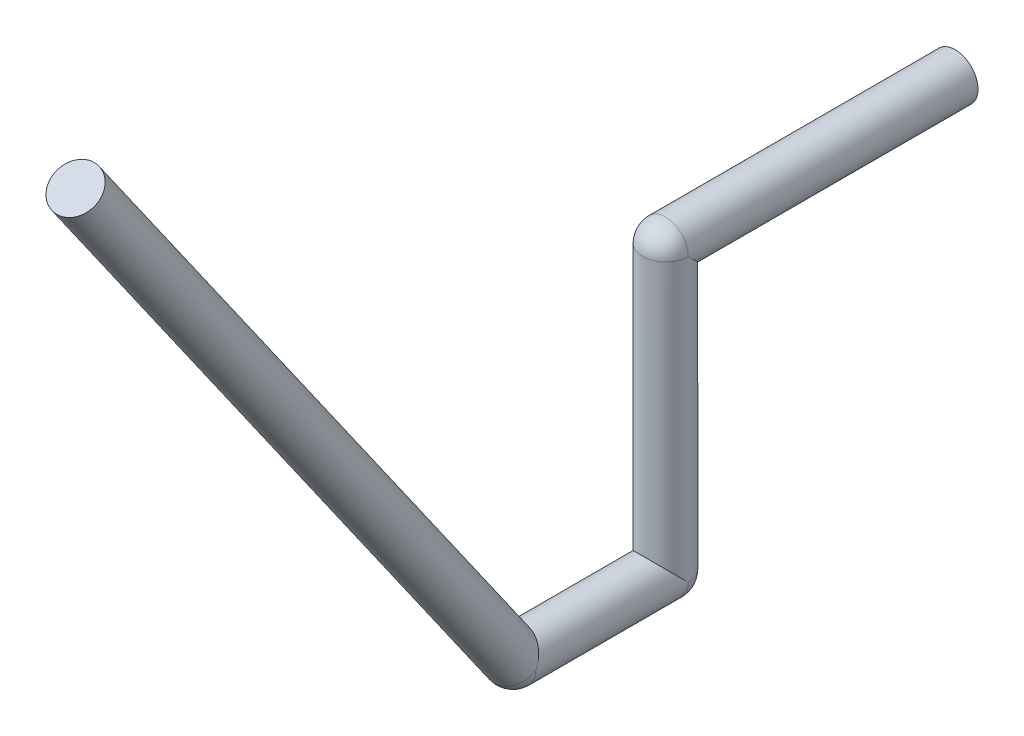
ISO-10303-21;
HEADER;
FILE_DESCRIPTION(('STEP AP214'),'2;1');
FILE_NAME('part.step','',(''),(''),'','','');
FILE_SCHEMA(('AUTOMOTIVE_DESIGN { 1 0 10303 214 1 1 1 1 }'));
ENDSEC;
DATA;
#1=APPLICATION_CONTEXT('core data for automotive mechanical design processes');
#2=APPLICATION_PROTOCOL_DEFINITION('international standard','automotive_design',2000,#1);
#3=PRODUCT_CONTEXT('',#1,'mechanical');
#4=PRODUCT('Part','Part','',(#3));
#5=PRODUCT_RELATED_PRODUCT_CATEGORY('part','',(#4));
#6=PRODUCT_DEFINITION_FORMATION('','',#4);
#7=PRODUCT_DEFINITION_CONTEXT('part definition',#1,'design');
#8=PRODUCT_DEFINITION('design','',#6,#7);
#9=PRODUCT_DEFINITION_SHAPE('','',#8);
#10=(LENGTH_UNIT() NAMED_UNIT(*) SI_UNIT(.MILLI.,.METRE.));
#11=(NAMED_UNIT(*) PLANE_ANGLE_UNIT() SI_UNIT($,.RADIAN.));
#12=(NAMED_UNIT(*) SI_UNIT($,.STERADIAN.) SOLID_ANGLE_UNIT());
#13=UNCERTAINTY_MEASURE_WITH_UNIT(LENGTH_MEASURE(1.E-05),#10,'distance_accuracy_value','');
#14=(GEOMETRIC_REPRESENTATION_CONTEXT(3) GLOBAL_UNCERTAINTY_ASSIGNED_CONTEXT((#13)) GLOBAL_UNIT_ASSIGNED_CONTEXT((#10,
#11,#12)) REPRESENTATION_CONTEXT('',''));
#15=CARTESIAN_POINT('',(0.,0.,0.));
#16=DIRECTION('',(0.,0.,1.));
#17=DIRECTION('',(1.,0.,0.));
#18=AXIS2_PLACEMENT_3D('',#15,#16,#17);
#19=CARTESIAN_POINT('',(1.8,12.49152044289,9.03576436351));
#20=DIRECTION('',(0.,0.819152044289016,0.573576436351011));
#21=DIRECTION('',(1.,0.,0.));
#22=AXIS2_PLACEMENT_3D('',#19,#20,#21);
#23=PLANE('',#22);
#24=CARTESIAN_POINT('',(1.8,12.49152044289,9.03576436351));
#25=DIRECTION('',(0.,0.819152044289016,0.573576436351011));
#26=DIRECTION('',(1.,0.,0.));
#27=AXIS2_PLACEMENT_3D('',#24,#25,#26);
#28=CIRCLE('',#27,0.3);
#29=CARTESIAN_POINT('',(1.5,12.49152044289,9.03576436351));
#30=VERTEX_POINT('',#29);
#31=EDGE_CURVE('E146',#30,#30,#28,.T.);
#32=ORIENTED_EDGE('',*,*,#31,.T.);
#33=EDGE_LOOP('',(#32));
#34=FACE_BOUND('',#33,.T.);
#35=ADVANCED_FACE('F17',(#34),#23,.T.);
#36=CARTESIAN_POINT('',(1.8,4.3,3.3));
#37=DIRECTION('',(0.,0.,1.));
#38=DIRECTION('',(1.,0.,0.));
#39=AXIS2_PLACEMENT_3D('',#36,#37,#38);
#40=SPHERICAL_SURFACE('',#39,0.3);
#41=CARTESIAN_POINT('',(1.8,4.3,3.3));
#42=DIRECTION('',(0.,0.,1.));
#43=DIRECTION('',(1.,0.,0.));
#44=AXIS2_PLACEMENT_3D('',#41,#42,#43);
#45=CIRCLE('',#44,0.3);
#46=CARTESIAN_POINT('',(1.5,4.3,3.3));
#47=VERTEX_POINT('',#46);
#48=CARTESIAN_POINT('',(2.1,4.3,3.3));
#49=VERTEX_POINT('',#48);
#50=EDGE_CURVE('E21',#47,#49,#45,.T.);
#51=ORIENTED_EDGE('',*,*,#50,.T.);
#52=CARTESIAN_POINT('',(1.8,4.3,3.3));
#53=DIRECTION('',(0.,0.819152044289016,0.573576436351011));
#54=DIRECTION('',(1.,0.,0.));
#55=AXIS2_PLACEMENT_3D('',#52,#53,#54);
#56=CIRCLE('',#55,0.3);
#57=EDGE_CURVE('E11',#47,#49,#56,.T.);
#58=ORIENTED_EDGE('',*,*,#57,.F.);
#59=EDGE_LOOP('',(#51,#58));
#60=FACE_BOUND('',#59,.T.);
#61=ADVANCED_FACE('F169',(#60),#40,.T.);
#62=CARTESIAN_POINT('',(1.8,4.3,3.3));
#63=DIRECTION('',(0.,0.819152044289016,0.573576436351011));
#64=DIRECTION('',(1.,0.,0.));
#65=AXIS2_PLACEMENT_3D('',#62,#63,#64);
#66=CYLINDRICAL_SURFACE('',#65,0.3);
#67=ORIENTED_EDGE('',*,*,#31,.F.);
#68=DIRECTION('',(0.,-0.819152044289016,-0.573576436351011));
#69=VECTOR('',#68,1.);
#70=CARTESIAN_POINT('',(1.5,4.3,3.3));
#71=LINE('',#70,#69);
#72=EDGE_CURVE('E28',#30,#47,#71,.T.);
#73=ORIENTED_EDGE('',*,*,#72,.T.);
#74=ORIENTED_EDGE('',*,*,#57,.T.);
#75=CARTESIAN_POINT('',(1.8,4.3,3.3));
#76=DIRECTION('',(0.,0.461748613235098,0.887010833178188));
#77=DIRECTION('',(0.,0.887010833178188,-0.461748613235098));
#78=AXIS2_PLACEMENT_3D('',#75,#76,#77);
#79=ELLIPSE('',#78,0.33821458406,0.3);
#80=EDGE_CURVE('E121',#49,#47,#79,.T.);
#81=ORIENTED_EDGE('',*,*,#80,.T.);
#82=ORIENTED_EDGE('',*,*,#72,.F.);
#83=EDGE_LOOP('',(#67,#73,#74,#81,#82));
#84=FACE_BOUND('',#83,.T.);
#85=ADVANCED_FACE('F19',(#84),#66,.T.);
#86=CARTESIAN_POINT('',(1.8,4.3,1.3));
#87=DIRECTION('',(0.577350269189626,0.577350269189626,0.577350269189626));
#88=DIRECTION('',(-0.707106781186548,0.,0.707106781186548));
#89=AXIS2_PLACEMENT_3D('',#86,#87,#88);
#90=SPHERICAL_SURFACE('',#89,0.3);
#91=CARTESIAN_POINT('',(1.8,4.3,1.3));
#92=DIRECTION('',(0.,-1.,0.));
#93=DIRECTION('',(1.,0.,0.));
#94=AXIS2_PLACEMENT_3D('',#91,#92,#93);
#95=CIRCLE('',#94,0.3);
#96=CARTESIAN_POINT('',(1.5,4.3,1.3));
#97=VERTEX_POINT('',#96);
#98=CARTESIAN_POINT('',(2.01213203435596,4.3,1.08786796564404));
#99=VERTEX_POINT('',#98);
#100=EDGE_CURVE('E128',#97,#99,#95,.T.);
#101=ORIENTED_EDGE('',*,*,#100,.T.);
#102=CARTESIAN_POINT('',(1.8,4.3,1.3));
#103=DIRECTION('',(-0.408248290463863,0.816496580927726,-0.408248290463863));
#104=DIRECTION('',(0.707106781186548,0.,-0.707106781186548));
#105=AXIS2_PLACEMENT_3D('',#102,#103,#104);
#106=CIRCLE('',#105,0.3);
#107=CARTESIAN_POINT('',(1.62679491924311,4.12679491924311,1.12679491924311));
#108=VERTEX_POINT('',#107);
#109=EDGE_CURVE('E124',#99,#108,#106,.T.);
#110=ORIENTED_EDGE('',*,*,#109,.T.);
#111=ORIENTED_EDGE('',*,*,#109,.F.);
#112=CARTESIAN_POINT('',(1.8,4.3,1.3));
#113=DIRECTION('',(0.,-1.,0.));
#114=DIRECTION('',(1.,0.,0.));
#115=AXIS2_PLACEMENT_3D('',#112,#113,#114);
#116=CIRCLE('',#115,0.3);
#117=CARTESIAN_POINT('',(2.1,4.3,1.3));
#118=VERTEX_POINT('',#117);
#119=EDGE_CURVE('E144',#99,#118,#116,.T.);
#120=ORIENTED_EDGE('',*,*,#119,.T.);
#121=CARTESIAN_POINT('',(1.8,4.3,1.3));
#122=DIRECTION('',(0.,0.,1.));
#123=DIRECTION('',(1.,0.,0.));
#124=AXIS2_PLACEMENT_3D('',#121,#122,#123);
#125=CIRCLE('',#124,0.3);
#126=EDGE_CURVE('E125',#97,#118,#125,.T.);
#127=ORIENTED_EDGE('',*,*,#126,.F.);
#128=EDGE_LOOP('',(#101,#110,#111,#120,#127));
#129=FACE_BOUND('',#128,.T.);
#130=ADVANCED_FACE('F189',(#129),#90,.T.);
#131=CARTESIAN_POINT('',(1.8,4.3,1.3));
#132=DIRECTION('',(0.,0.,1.));
#133=DIRECTION('',(1.,0.,0.));
#134=AXIS2_PLACEMENT_3D('',#131,#132,#133);
#135=CYLINDRICAL_SURFACE('',#134,0.3);
#136=ORIENTED_EDGE('',*,*,#50,.F.);
#137=DIRECTION('',(0.,0.,-1.));
#138=VECTOR('',#137,1.);
#139=CARTESIAN_POINT('',(1.5,4.3,1.3));
#140=LINE('',#139,#138);
#141=EDGE_CURVE('E140',#47,#97,#140,.T.);
#142=ORIENTED_EDGE('',*,*,#141,.T.);
#143=ORIENTED_EDGE('',*,*,#126,.T.);
#144=CARTESIAN_POINT('',(1.8,4.3,1.3));
#145=DIRECTION('',(0.,-0.707106781186548,0.707106781186548));
#146=DIRECTION('',(0.,-0.707106781186548,-0.707106781186548));
#147=AXIS2_PLACEMENT_3D('',#144,#145,#146);
#148=ELLIPSE('',#147,0.424264068712,0.3);
#149=EDGE_CURVE('E127',#118,#97,#148,.T.);
#150=ORIENTED_EDGE('',*,*,#149,.T.);
#151=ORIENTED_EDGE('',*,*,#141,.F.);
#152=ORIENTED_EDGE('',*,*,#80,.F.);
#153=EDGE_LOOP('',(#136,#142,#143,#150,#151,#152));
#154=FACE_BOUND('',#153,.T.);
#155=ADVANCED_FACE('F171',(#154),#135,.T.);
#156=CARTESIAN_POINT('',(1.8,8.,1.3));
#157=DIRECTION('',(0.,-1.,0.));
#158=DIRECTION('',(1.,0.,0.));
#159=AXIS2_PLACEMENT_3D('',#156,#157,#158);
#160=CYLINDRICAL_SURFACE('',#159,0.3);
#161=ORIENTED_EDGE('',*,*,#100,.F.);
#162=DIRECTION('',(0.,1.,0.));
#163=VECTOR('',#162,1.);
#164=CARTESIAN_POINT('',(1.5,8.,1.3));
#165=LINE('',#164,#163);
#166=CARTESIAN_POINT('',(1.5,8.,1.3));
#167=VERTEX_POINT('',#166);
#168=EDGE_CURVE('E106',#97,#167,#165,.T.);
#169=ORIENTED_EDGE('',*,*,#168,.T.);
#170=CARTESIAN_POINT('',(1.8,8.,1.3));
#171=DIRECTION('',(0.,-0.707106781186548,0.707106781186548));
#172=DIRECTION('',(0.,0.707106781186548,0.707106781186548));
#173=AXIS2_PLACEMENT_3D('',#170,#171,#172);
#174=ELLIPSE('',#173,0.424264068712,0.3);
#175=CARTESIAN_POINT('',(2.1,8.,1.3));
#176=VERTEX_POINT('',#175);
#177=EDGE_CURVE('E101',#167,#176,#174,.T.);
#178=ORIENTED_EDGE('',*,*,#177,.T.);
#179=CARTESIAN_POINT('',(1.8,8.,1.3));
#180=DIRECTION('',(0.,-1.,0.));
#181=DIRECTION('',(1.,0.,0.));
#182=AXIS2_PLACEMENT_3D('',#179,#180,#181);
#183=CIRCLE('',#182,0.3);
#184=EDGE_CURVE('E85',#176,#167,#183,.T.);
#185=ORIENTED_EDGE('',*,*,#184,.T.);
#186=ORIENTED_EDGE('',*,*,#168,.F.);
#187=ORIENTED_EDGE('',*,*,#149,.F.);
#188=ORIENTED_EDGE('',*,*,#119,.F.);
#189=EDGE_LOOP('',(#161,#169,#178,#185,#186,#187,#188));
#190=FACE_BOUND('',#189,.T.);
#191=ADVANCED_FACE('F105',(#190),#160,.T.);
#192=CARTESIAN_POINT('',(1.8,8.,1.3));
#193=DIRECTION('',(0.577350269189625,0.577350269189628,0.577350269189625));
#194=DIRECTION('',(-0.707106781186548,0.,0.707106781186548));
#195=AXIS2_PLACEMENT_3D('',#192,#193,#194);
#196=SPHERICAL_SURFACE('',#195,0.3);
#197=ORIENTED_EDGE('',*,*,#184,.F.);
#198=CARTESIAN_POINT('',(1.8,8.,1.3));
#199=DIRECTION('',(0.,0.,1.));
#200=DIRECTION('',(1.,0.,0.));
#201=AXIS2_PLACEMENT_3D('',#198,#199,#200);
#202=CIRCLE('',#201,0.3);
#203=CARTESIAN_POINT('',(2.06832815729997,8.13416407864999,1.3));
#204=VERTEX_POINT('',#203);
#205=EDGE_CURVE('E88',#176,#204,#202,.T.);
#206=ORIENTED_EDGE('',*,*,#205,.T.);
#207=CARTESIAN_POINT('',(1.8,8.,1.3));
#208=DIRECTION('',(-0.408248290463863,0.816496580927726,-0.408248290463863));
#209=DIRECTION('',(0.707106781186548,0.,-0.707106781186548));
#210=AXIS2_PLACEMENT_3D('',#207,#208,#209);
#211=CIRCLE('',#210,0.3);
#212=CARTESIAN_POINT('',(1.97320508075689,8.17320508075689,1.47320508075689));
#213=VERTEX_POINT('',#212);
#214=EDGE_CURVE('E96',#213,#204,#211,.T.);
#215=ORIENTED_EDGE('',*,*,#214,.F.);
#216=ORIENTED_EDGE('',*,*,#214,.T.);
#217=CARTESIAN_POINT('',(1.8,8.,1.3));
#218=DIRECTION('',(0.,0.,1.));
#219=DIRECTION('',(1.,0.,0.));
#220=AXIS2_PLACEMENT_3D('',#217,#218,#219);
#221=CIRCLE('',#220,0.3);
#222=EDGE_CURVE('E90',#204,#167,#221,.T.);
#223=ORIENTED_EDGE('',*,*,#222,.T.);
#224=EDGE_LOOP('',(#197,#206,#215,#216,#223));
#225=FACE_BOUND('',#224,.T.);
#226=ADVANCED_FACE('F87',(#225),#196,.T.);
#227=CARTESIAN_POINT('',(1.8,8.,-2.5));
#228=DIRECTION('',(0.,0.,1.));
#229=DIRECTION('',(1.,0.,0.));
#230=AXIS2_PLACEMENT_3D('',#227,#228,#229);
#231=CYLINDRICAL_SURFACE('',#230,0.3);
#232=ORIENTED_EDGE('',*,*,#177,.F.);
#233=DIRECTION('',(0.,0.,-1.));
#234=VECTOR('',#233,1.);
#235=CARTESIAN_POINT('',(1.5,8.,-2.5));
#236=LINE('',#235,#234);
#237=CARTESIAN_POINT('',(1.5,8.,-2.5));
#238=VERTEX_POINT('',#237);
#239=EDGE_CURVE('E108',#167,#238,#236,.T.);
#240=ORIENTED_EDGE('',*,*,#239,.T.);
#241=CARTESIAN_POINT('',(1.8,8.,-2.5));
#242=DIRECTION('',(0.,0.,1.));
#243=DIRECTION('',(1.,0.,0.));
#244=AXIS2_PLACEMENT_3D('',#241,#242,#243);
#245=CIRCLE('',#244,0.3);
#246=EDGE_CURVE('E109',#238,#238,#245,.T.);
#247=ORIENTED_EDGE('',*,*,#246,.T.);
#248=ORIENTED_EDGE('',*,*,#239,.F.);
#249=ORIENTED_EDGE('',*,*,#222,.F.);
#250=ORIENTED_EDGE('',*,*,#205,.F.);
#251=EDGE_LOOP('',(#232,#240,#247,#248,#249,#250));
#252=FACE_BOUND('',#251,.T.);
#253=ADVANCED_FACE('F100',(#252),#231,.T.);
#254=CARTESIAN_POINT('',(1.8,8.,-2.5));
#255=DIRECTION('',(0.,0.,1.));
#256=DIRECTION('',(1.,0.,0.));
#257=AXIS2_PLACEMENT_3D('',#254,#255,#256);
#258=PLANE('',#257);
#259=ORIENTED_EDGE('',*,*,#246,.F.);
#260=EDGE_LOOP('',(#259));
#261=FACE_BOUND('',#260,.T.);
#262=ADVANCED_FACE('F198',(#261),#258,.F.);
#263=CLOSED_SHELL('',(#35,#61,#85,#130,#155,#191,#226,#253,#262));
#264=MANIFOLD_SOLID_BREP('B1',#263);
#265=ADVANCED_BREP_SHAPE_REPRESENTATION('',(#18,#264),#14);
#266=SHAPE_DEFINITION_REPRESENTATION(#9,#265);
ENDSEC;
END-ISO-10303-21;
